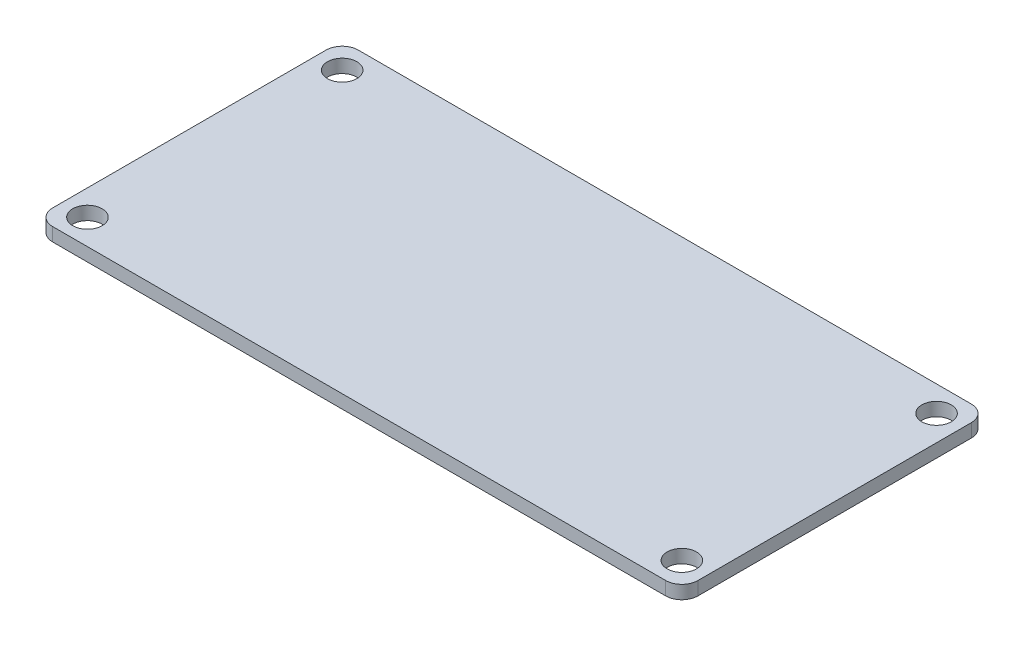
ISO-10303-21;
HEADER;
FILE_DESCRIPTION(('STEP AP214'),'2;1');
FILE_NAME('part.step','',(''),(''),'','','');
FILE_SCHEMA(('AUTOMOTIVE_DESIGN { 1 0 10303 214 1 1 1 1 }'));
ENDSEC;
DATA;
#1=APPLICATION_CONTEXT('core data for automotive mechanical design processes');
#2=APPLICATION_PROTOCOL_DEFINITION('international standard','automotive_design',2000,#1);
#3=PRODUCT_CONTEXT('',#1,'mechanical');
#4=PRODUCT('Part','Part','',(#3));
#5=PRODUCT_RELATED_PRODUCT_CATEGORY('part','',(#4));
#6=PRODUCT_DEFINITION_FORMATION('','',#4);
#7=PRODUCT_DEFINITION_CONTEXT('part definition',#1,'design');
#8=PRODUCT_DEFINITION('design','',#6,#7);
#9=PRODUCT_DEFINITION_SHAPE('','',#8);
#10=(LENGTH_UNIT() NAMED_UNIT(*) SI_UNIT(.MILLI.,.METRE.));
#11=(NAMED_UNIT(*) PLANE_ANGLE_UNIT() SI_UNIT($,.RADIAN.));
#12=(NAMED_UNIT(*) SI_UNIT($,.STERADIAN.) SOLID_ANGLE_UNIT());
#13=UNCERTAINTY_MEASURE_WITH_UNIT(LENGTH_MEASURE(1.E-05),#10,'distance_accuracy_value','');
#14=(GEOMETRIC_REPRESENTATION_CONTEXT(3) GLOBAL_UNCERTAINTY_ASSIGNED_CONTEXT((#13)) GLOBAL_UNIT_ASSIGNED_CONTEXT((#10,
#11,#12)) REPRESENTATION_CONTEXT('',''));
#15=CARTESIAN_POINT('',(0.,0.,0.));
#16=DIRECTION('',(0.,0.,1.));
#17=DIRECTION('',(1.,0.,0.));
#18=AXIS2_PLACEMENT_3D('',#15,#16,#17);
#19=CARTESIAN_POINT('',(0.,1.,0.));
#20=DIRECTION('',(1.,0.,0.));
#21=DIRECTION('',(0.,0.,-1.));
#22=AXIS2_PLACEMENT_3D('',#19,#20,#21);
#23=PLANE('',#22);
#24=DIRECTION('',(0.,0.,1.));
#25=VECTOR('',#24,1.);
#26=CARTESIAN_POINT('',(0.,1.,0.));
#27=LINE('',#26,#25);
#28=CARTESIAN_POINT('',(0.,1.,-21.6535));
#29=VERTEX_POINT('',#28);
#30=CARTESIAN_POINT('',(0.,1.,-1.2065));
#31=VERTEX_POINT('',#30);
#32=EDGE_CURVE('E184',#29,#31,#27,.T.);
#33=ORIENTED_EDGE('',*,*,#32,.F.);
#34=DIRECTION('',(0.,-1.,0.));
#35=VECTOR('',#34,1.);
#36=CARTESIAN_POINT('',(0.,1.,-21.6535));
#37=LINE('',#36,#35);
#38=CARTESIAN_POINT('',(0.,0.,-21.6535));
#39=VERTEX_POINT('',#38);
#40=EDGE_CURVE('E42',#29,#39,#37,.T.);
#41=ORIENTED_EDGE('',*,*,#40,.T.);
#42=DIRECTION('',(0.,0.,1.));
#43=VECTOR('',#42,1.);
#44=CARTESIAN_POINT('',(0.,0.,0.));
#45=LINE('',#44,#43);
#46=CARTESIAN_POINT('',(0.,0.,-15.43));
#47=VERTEX_POINT('',#46);
#48=EDGE_CURVE('E198',#39,#47,#45,.T.);
#49=ORIENTED_EDGE('',*,*,#48,.T.);
#50=CARTESIAN_POINT('',(0.,0.,-7.43));
#51=VERTEX_POINT('',#50);
#52=EDGE_CURVE('E202',#47,#51,#45,.T.);
#53=ORIENTED_EDGE('',*,*,#52,.T.);
#54=CARTESIAN_POINT('',(0.,0.,-1.2065));
#55=VERTEX_POINT('',#54);
#56=EDGE_CURVE('E183',#51,#55,#45,.T.);
#57=ORIENTED_EDGE('',*,*,#56,.T.);
#58=DIRECTION('',(0.,-1.,0.));
#59=VECTOR('',#58,1.);
#60=CARTESIAN_POINT('',(0.,1.,-1.2065));
#61=LINE('',#60,#59);
#62=EDGE_CURVE('E240',#55,#31,#61,.F.);
#63=ORIENTED_EDGE('',*,*,#62,.T.);
#64=EDGE_LOOP('',(#33,#41,#49,#53,#57,#63));
#65=FACE_BOUND('',#64,.T.);
#66=ADVANCED_FACE('F38',(#65),#23,.F.);
#67=CARTESIAN_POINT('',(0.,1.,0.));
#68=DIRECTION('',(0.,0.,-1.));
#69=DIRECTION('',(-1.,0.,0.));
#70=AXIS2_PLACEMENT_3D('',#67,#68,#69);
#71=PLANE('',#70);
#72=DIRECTION('',(1.,0.,0.));
#73=VECTOR('',#72,1.);
#74=CARTESIAN_POINT('',(0.,0.,0.));
#75=LINE('',#74,#73);
#76=CARTESIAN_POINT('',(1.2065,0.,0.));
#77=VERTEX_POINT('',#76);
#78=CARTESIAN_POINT('',(47.0535,0.,0.));
#79=VERTEX_POINT('',#78);
#80=EDGE_CURVE('E201',#77,#79,#75,.T.);
#81=ORIENTED_EDGE('',*,*,#80,.T.);
#82=DIRECTION('',(0.,-1.,0.));
#83=VECTOR('',#82,1.);
#84=CARTESIAN_POINT('',(47.0535,1.,0.));
#85=LINE('',#84,#83);
#86=CARTESIAN_POINT('',(47.0535,1.,0.));
#87=VERTEX_POINT('',#86);
#88=EDGE_CURVE('E239',#79,#87,#85,.F.);
#89=ORIENTED_EDGE('',*,*,#88,.T.);
#90=DIRECTION('',(1.,0.,0.));
#91=VECTOR('',#90,1.);
#92=CARTESIAN_POINT('',(0.,1.,0.));
#93=LINE('',#92,#91);
#94=CARTESIAN_POINT('',(1.2065,1.,0.));
#95=VERTEX_POINT('',#94);
#96=EDGE_CURVE('E187',#95,#87,#93,.T.);
#97=ORIENTED_EDGE('',*,*,#96,.F.);
#98=DIRECTION('',(0.,-1.,0.));
#99=VECTOR('',#98,1.);
#100=CARTESIAN_POINT('',(1.2065,1.,0.));
#101=LINE('',#100,#99);
#102=EDGE_CURVE('E236',#95,#77,#101,.T.);
#103=ORIENTED_EDGE('',*,*,#102,.T.);
#104=EDGE_LOOP('',(#81,#89,#97,#103));
#105=FACE_BOUND('',#104,.T.);
#106=ADVANCED_FACE('F283',(#105),#71,.F.);
#107=CARTESIAN_POINT('',(48.26,1.,0.));
#108=DIRECTION('',(-1.,0.,0.));
#109=DIRECTION('',(0.,0.,1.));
#110=AXIS2_PLACEMENT_3D('',#107,#108,#109);
#111=PLANE('',#110);
#112=DIRECTION('',(0.,0.,-1.));
#113=VECTOR('',#112,1.);
#114=CARTESIAN_POINT('',(48.26,0.,0.));
#115=LINE('',#114,#113);
#116=CARTESIAN_POINT('',(48.26,0.,-1.2065));
#117=VERTEX_POINT('',#116);
#118=CARTESIAN_POINT('',(48.26,0.,-21.6535));
#119=VERTEX_POINT('',#118);
#120=EDGE_CURVE('E205',#117,#119,#115,.T.);
#121=ORIENTED_EDGE('',*,*,#120,.T.);
#122=DIRECTION('',(0.,-1.,0.));
#123=VECTOR('',#122,1.);
#124=CARTESIAN_POINT('',(48.26,1.,-21.6535));
#125=LINE('',#124,#123);
#126=CARTESIAN_POINT('',(48.26,1.,-21.6535));
#127=VERTEX_POINT('',#126);
#128=EDGE_CURVE('E226',#119,#127,#125,.F.);
#129=ORIENTED_EDGE('',*,*,#128,.T.);
#130=DIRECTION('',(0.,0.,-1.));
#131=VECTOR('',#130,1.);
#132=CARTESIAN_POINT('',(48.26,1.,0.));
#133=LINE('',#132,#131);
#134=CARTESIAN_POINT('',(48.26,1.,-1.2065));
#135=VERTEX_POINT('',#134);
#136=EDGE_CURVE('E191',#135,#127,#133,.T.);
#137=ORIENTED_EDGE('',*,*,#136,.F.);
#138=DIRECTION('',(0.,-1.,0.));
#139=VECTOR('',#138,1.);
#140=CARTESIAN_POINT('',(48.26,1.,-1.2065));
#141=LINE('',#140,#139);
#142=EDGE_CURVE('E223',#135,#117,#141,.T.);
#143=ORIENTED_EDGE('',*,*,#142,.T.);
#144=EDGE_LOOP('',(#121,#129,#137,#143));
#145=FACE_BOUND('',#144,.T.);
#146=ADVANCED_FACE('F291',(#145),#111,.F.);
#147=CARTESIAN_POINT('',(0.,1.,-22.86));
#148=DIRECTION('',(0.,0.,1.));
#149=DIRECTION('',(1.,0.,0.));
#150=AXIS2_PLACEMENT_3D('',#147,#148,#149);
#151=PLANE('',#150);
#152=DIRECTION('',(-1.,0.,0.));
#153=VECTOR('',#152,1.);
#154=CARTESIAN_POINT('',(0.,1.,-22.86));
#155=LINE('',#154,#153);
#156=CARTESIAN_POINT('',(47.0535,1.,-22.86));
#157=VERTEX_POINT('',#156);
#158=CARTESIAN_POINT('',(1.2065,1.,-22.86));
#159=VERTEX_POINT('',#158);
#160=EDGE_CURVE('E194',#157,#159,#155,.T.);
#161=ORIENTED_EDGE('',*,*,#160,.F.);
#162=DIRECTION('',(0.,-1.,0.));
#163=VECTOR('',#162,1.);
#164=CARTESIAN_POINT('',(47.0535,1.,-22.86));
#165=LINE('',#164,#163);
#166=CARTESIAN_POINT('',(47.0535,0.,-22.86));
#167=VERTEX_POINT('',#166);
#168=EDGE_CURVE('E211',#157,#167,#165,.T.);
#169=ORIENTED_EDGE('',*,*,#168,.T.);
#170=DIRECTION('',(-1.,0.,0.));
#171=VECTOR('',#170,1.);
#172=CARTESIAN_POINT('',(0.,0.,-22.86));
#173=LINE('',#172,#171);
#174=CARTESIAN_POINT('',(1.2065,0.,-22.86));
#175=VERTEX_POINT('',#174);
#176=EDGE_CURVE('E188',#167,#175,#173,.T.);
#177=ORIENTED_EDGE('',*,*,#176,.T.);
#178=DIRECTION('',(0.,-1.,0.));
#179=VECTOR('',#178,1.);
#180=CARTESIAN_POINT('',(1.2065,1.,-22.86));
#181=LINE('',#180,#179);
#182=EDGE_CURVE('E197',#175,#159,#181,.F.);
#183=ORIENTED_EDGE('',*,*,#182,.T.);
#184=EDGE_LOOP('',(#161,#169,#177,#183));
#185=FACE_BOUND('',#184,.T.);
#186=ADVANCED_FACE('F299',(#185),#151,.F.);
#187=CARTESIAN_POINT('',(0.,1.,0.));
#188=DIRECTION('',(0.,-1.,0.));
#189=DIRECTION('',(0.,0.,-1.));
#190=AXIS2_PLACEMENT_3D('',#187,#188,#189);
#191=PLANE('',#190);
#192=CARTESIAN_POINT('',(46.355,1.,-20.955));
#193=DIRECTION('',(0.,-1.,0.));
#194=DIRECTION('',(0.,0.,-1.));
#195=AXIS2_PLACEMENT_3D('',#192,#193,#194);
#196=CIRCLE('',#195,1.09982);
#197=CARTESIAN_POINT('',(46.355,1.,-22.05482));
#198=VERTEX_POINT('',#197);
#199=EDGE_CURVE('E180',#198,#198,#196,.T.);
#200=ORIENTED_EDGE('',*,*,#199,.T.);
#201=EDGE_LOOP('',(#200));
#202=FACE_BOUND('',#201,.T.);
#203=CARTESIAN_POINT('',(46.355,1.,-1.905));
#204=DIRECTION('',(0.,-1.,0.));
#205=DIRECTION('',(0.,0.,-1.));
#206=AXIS2_PLACEMENT_3D('',#203,#204,#205);
#207=CIRCLE('',#206,1.09982);
#208=CARTESIAN_POINT('',(46.355,1.,-3.00482));
#209=VERTEX_POINT('',#208);
#210=EDGE_CURVE('E177',#209,#209,#207,.T.);
#211=ORIENTED_EDGE('',*,*,#210,.T.);
#212=EDGE_LOOP('',(#211));
#213=FACE_BOUND('',#212,.T.);
#214=CARTESIAN_POINT('',(1.905,1.,-1.905));
#215=DIRECTION('',(0.,-1.,0.));
#216=DIRECTION('',(0.,0.,-1.));
#217=AXIS2_PLACEMENT_3D('',#214,#215,#216);
#218=CIRCLE('',#217,1.09982);
#219=CARTESIAN_POINT('',(1.905,1.,-3.00482));
#220=VERTEX_POINT('',#219);
#221=EDGE_CURVE('E174',#220,#220,#218,.T.);
#222=ORIENTED_EDGE('',*,*,#221,.T.);
#223=EDGE_LOOP('',(#222));
#224=FACE_BOUND('',#223,.T.);
#225=CARTESIAN_POINT('',(1.905,1.,-20.955));
#226=DIRECTION('',(0.,-1.,0.));
#227=DIRECTION('',(0.,0.,-1.));
#228=AXIS2_PLACEMENT_3D('',#225,#226,#227);
#229=CIRCLE('',#228,1.09982);
#230=CARTESIAN_POINT('',(1.905,1.,-22.05482));
#231=VERTEX_POINT('',#230);
#232=EDGE_CURVE('E171',#231,#231,#229,.T.);
#233=ORIENTED_EDGE('',*,*,#232,.T.);
#234=EDGE_LOOP('',(#233));
#235=FACE_BOUND('',#234,.T.);
#236=ORIENTED_EDGE('',*,*,#136,.T.);
#237=CARTESIAN_POINT('',(47.0535,1.,-21.6535));
#238=DIRECTION('',(0.,-1.,0.));
#239=DIRECTION('',(0.,0.,-1.));
#240=AXIS2_PLACEMENT_3D('',#237,#238,#239);
#241=CIRCLE('',#240,1.2065);
#242=EDGE_CURVE('E234',#127,#157,#241,.F.);
#243=ORIENTED_EDGE('',*,*,#242,.T.);
#244=ORIENTED_EDGE('',*,*,#160,.T.);
#245=CARTESIAN_POINT('',(1.2065,1.,-21.6535));
#246=DIRECTION('',(0.,-1.,0.));
#247=DIRECTION('',(0.,0.,-1.));
#248=AXIS2_PLACEMENT_3D('',#245,#246,#247);
#249=CIRCLE('',#248,1.2065);
#250=EDGE_CURVE('E230',#159,#29,#249,.F.);
#251=ORIENTED_EDGE('',*,*,#250,.T.);
#252=ORIENTED_EDGE('',*,*,#32,.T.);
#253=CARTESIAN_POINT('',(1.2065,1.,-1.2065));
#254=DIRECTION('',(0.,-1.,0.));
#255=DIRECTION('',(0.,0.,-1.));
#256=AXIS2_PLACEMENT_3D('',#253,#254,#255);
#257=CIRCLE('',#256,1.2065);
#258=EDGE_CURVE('E228',#31,#95,#257,.F.);
#259=ORIENTED_EDGE('',*,*,#258,.T.);
#260=ORIENTED_EDGE('',*,*,#96,.T.);
#261=CARTESIAN_POINT('',(47.0535,1.,-1.2065));
#262=DIRECTION('',(0.,-1.,0.));
#263=DIRECTION('',(0.,0.,-1.));
#264=AXIS2_PLACEMENT_3D('',#261,#262,#263);
#265=CIRCLE('',#264,1.2065);
#266=EDGE_CURVE('E232',#87,#135,#265,.F.);
#267=ORIENTED_EDGE('',*,*,#266,.T.);
#268=EDGE_LOOP('',(#236,#243,#244,#251,#252,#259,#260,#267));
#269=FACE_BOUND('',#268,.T.);
#270=ADVANCED_FACE('F280',(#202,#213,#224,#235,#269),#191,.F.);
#271=CARTESIAN_POINT('',(0.,0.,0.));
#272=DIRECTION('',(0.,-1.,0.));
#273=DIRECTION('',(0.,0.,-1.));
#274=AXIS2_PLACEMENT_3D('',#271,#272,#273);
#275=PLANE('',#274);
#276=DIRECTION('',(1.,0.,0.));
#277=VECTOR('',#276,1.);
#278=CARTESIAN_POINT('',(5.1,0.,-15.43));
#279=LINE('',#278,#277);
#280=CARTESIAN_POINT('',(5.1,0.,-15.43));
#281=VERTEX_POINT('',#280);
#282=EDGE_CURVE('E11',#47,#281,#279,.T.);
#283=ORIENTED_EDGE('',*,*,#282,.F.);
#284=ORIENTED_EDGE('',*,*,#48,.F.);
#285=CARTESIAN_POINT('',(1.2065,0.,-21.6535));
#286=DIRECTION('',(0.,-1.,0.));
#287=DIRECTION('',(0.,0.,-1.));
#288=AXIS2_PLACEMENT_3D('',#285,#286,#287);
#289=CIRCLE('',#288,1.2065);
#290=EDGE_CURVE('E217',#39,#175,#289,.T.);
#291=ORIENTED_EDGE('',*,*,#290,.T.);
#292=ORIENTED_EDGE('',*,*,#176,.F.);
#293=CARTESIAN_POINT('',(47.0535,0.,-21.6535));
#294=DIRECTION('',(0.,-1.,0.));
#295=DIRECTION('',(0.,0.,-1.));
#296=AXIS2_PLACEMENT_3D('',#293,#294,#295);
#297=CIRCLE('',#296,1.2065);
#298=EDGE_CURVE('E221',#167,#119,#297,.T.);
#299=ORIENTED_EDGE('',*,*,#298,.T.);
#300=ORIENTED_EDGE('',*,*,#120,.F.);
#301=CARTESIAN_POINT('',(47.0535,0.,-1.2065));
#302=DIRECTION('',(0.,-1.,0.));
#303=DIRECTION('',(0.,0.,-1.));
#304=AXIS2_PLACEMENT_3D('',#301,#302,#303);
#305=CIRCLE('',#304,1.2065);
#306=EDGE_CURVE('E219',#117,#79,#305,.T.);
#307=ORIENTED_EDGE('',*,*,#306,.T.);
#308=ORIENTED_EDGE('',*,*,#80,.F.);
#309=CARTESIAN_POINT('',(1.2065,0.,-1.2065));
#310=DIRECTION('',(0.,-1.,0.));
#311=DIRECTION('',(0.,0.,-1.));
#312=AXIS2_PLACEMENT_3D('',#309,#310,#311);
#313=CIRCLE('',#312,1.2065);
#314=EDGE_CURVE('E214',#77,#55,#313,.T.);
#315=ORIENTED_EDGE('',*,*,#314,.T.);
#316=ORIENTED_EDGE('',*,*,#56,.F.);
#317=DIRECTION('',(-1.,0.,0.));
#318=VECTOR('',#317,1.);
#319=CARTESIAN_POINT('',(5.1,0.,-7.43));
#320=LINE('',#319,#318);
#321=CARTESIAN_POINT('',(5.1,0.,-7.43));
#322=VERTEX_POINT('',#321);
#323=EDGE_CURVE('E59',#322,#51,#320,.T.);
#324=ORIENTED_EDGE('',*,*,#323,.F.);
#325=DIRECTION('',(0.,0.,1.));
#326=VECTOR('',#325,1.);
#327=CARTESIAN_POINT('',(5.1,0.,-15.43));
#328=LINE('',#327,#326);
#329=EDGE_CURVE('E55',#281,#322,#328,.T.);
#330=ORIENTED_EDGE('',*,*,#329,.F.);
#331=EDGE_LOOP('',(#283,#284,#291,#292,#299,#300,#307,#308,#315,#316,#324,#330));
#332=FACE_BOUND('',#331,.T.);
#333=CARTESIAN_POINT('',(46.355,0.,-20.955));
#334=DIRECTION('',(0.,1.,0.));
#335=DIRECTION('',(0.,0.,1.));
#336=AXIS2_PLACEMENT_3D('',#333,#334,#335);
#337=CIRCLE('',#336,1.09982);
#338=CARTESIAN_POINT('',(46.355,0.,-19.85518));
#339=VERTEX_POINT('',#338);
#340=EDGE_CURVE('E154',#339,#339,#337,.T.);
#341=ORIENTED_EDGE('',*,*,#340,.T.);
#342=EDGE_LOOP('',(#341));
#343=FACE_BOUND('',#342,.T.);
#344=CARTESIAN_POINT('',(46.355,0.,-1.905));
#345=DIRECTION('',(0.,1.,0.));
#346=DIRECTION('',(0.,0.,1.));
#347=AXIS2_PLACEMENT_3D('',#344,#345,#346);
#348=CIRCLE('',#347,1.09982);
#349=CARTESIAN_POINT('',(46.355,0.,-0.805179999999998));
#350=VERTEX_POINT('',#349);
#351=EDGE_CURVE('E157',#350,#350,#348,.T.);
#352=ORIENTED_EDGE('',*,*,#351,.T.);
#353=EDGE_LOOP('',(#352));
#354=FACE_BOUND('',#353,.T.);
#355=CARTESIAN_POINT('',(1.905,0.,-1.905));
#356=DIRECTION('',(0.,1.,0.));
#357=DIRECTION('',(0.,0.,1.));
#358=AXIS2_PLACEMENT_3D('',#355,#356,#357);
#359=CIRCLE('',#358,1.09982);
#360=CARTESIAN_POINT('',(1.905,0.,-0.805180000000001));
#361=VERTEX_POINT('',#360);
#362=EDGE_CURVE('E163',#361,#361,#359,.T.);
#363=ORIENTED_EDGE('',*,*,#362,.T.);
#364=EDGE_LOOP('',(#363));
#365=FACE_BOUND('',#364,.T.);
#366=CARTESIAN_POINT('',(1.905,0.,-20.955));
#367=DIRECTION('',(0.,1.,0.));
#368=DIRECTION('',(0.,0.,1.));
#369=AXIS2_PLACEMENT_3D('',#366,#367,#368);
#370=CIRCLE('',#369,1.09982);
#371=CARTESIAN_POINT('',(1.905,0.,-19.85518));
#372=VERTEX_POINT('',#371);
#373=EDGE_CURVE('E166',#372,#372,#370,.T.);
#374=ORIENTED_EDGE('',*,*,#373,.T.);
#375=EDGE_LOOP('',(#374));
#376=FACE_BOUND('',#375,.T.);
#377=ADVANCED_FACE('F250',(#332,#343,#354,#365,#376),#275,.T.);
#378=CARTESIAN_POINT('',(1.905,0.,-20.955));
#379=DIRECTION('',(0.,1.,0.));
#380=DIRECTION('',(0.,0.,1.));
#381=AXIS2_PLACEMENT_3D('',#378,#379,#380);
#382=CYLINDRICAL_SURFACE('',#381,1.09982);
#383=ORIENTED_EDGE('',*,*,#373,.F.);
#384=EDGE_LOOP('',(#383));
#385=FACE_BOUND('',#384,.T.);
#386=ORIENTED_EDGE('',*,*,#232,.F.);
#387=EDGE_LOOP('',(#386));
#388=FACE_BOUND('',#387,.T.);
#389=ADVANCED_FACE('F334',(#385,#388),#382,.F.);
#390=CARTESIAN_POINT('',(1.905,0.,-1.905));
#391=DIRECTION('',(0.,1.,0.));
#392=DIRECTION('',(0.,0.,1.));
#393=AXIS2_PLACEMENT_3D('',#390,#391,#392);
#394=CYLINDRICAL_SURFACE('',#393,1.09982);
#395=ORIENTED_EDGE('',*,*,#362,.F.);
#396=EDGE_LOOP('',(#395));
#397=FACE_BOUND('',#396,.T.);
#398=ORIENTED_EDGE('',*,*,#221,.F.);
#399=EDGE_LOOP('',(#398));
#400=FACE_BOUND('',#399,.T.);
#401=ADVANCED_FACE('F327',(#397,#400),#394,.F.);
#402=CARTESIAN_POINT('',(46.355,0.,-1.905));
#403=DIRECTION('',(0.,1.,0.));
#404=DIRECTION('',(0.,0.,1.));
#405=AXIS2_PLACEMENT_3D('',#402,#403,#404);
#406=CYLINDRICAL_SURFACE('',#405,1.09982);
#407=ORIENTED_EDGE('',*,*,#351,.F.);
#408=EDGE_LOOP('',(#407));
#409=FACE_BOUND('',#408,.T.);
#410=ORIENTED_EDGE('',*,*,#210,.F.);
#411=EDGE_LOOP('',(#410));
#412=FACE_BOUND('',#411,.T.);
#413=ADVANCED_FACE('F321',(#409,#412),#406,.F.);
#414=CARTESIAN_POINT('',(46.355,0.,-20.955));
#415=DIRECTION('',(0.,1.,0.));
#416=DIRECTION('',(0.,0.,1.));
#417=AXIS2_PLACEMENT_3D('',#414,#415,#416);
#418=CYLINDRICAL_SURFACE('',#417,1.09982);
#419=ORIENTED_EDGE('',*,*,#340,.F.);
#420=EDGE_LOOP('',(#419));
#421=FACE_BOUND('',#420,.T.);
#422=ORIENTED_EDGE('',*,*,#199,.F.);
#423=EDGE_LOOP('',(#422));
#424=FACE_BOUND('',#423,.T.);
#425=ADVANCED_FACE('F317',(#421,#424),#418,.F.);
#426=CARTESIAN_POINT('',(47.0535,1.,-21.6535));
#427=DIRECTION('',(0.,-1.,0.));
#428=DIRECTION('',(0.,0.,-1.));
#429=AXIS2_PLACEMENT_3D('',#426,#427,#428);
#430=CYLINDRICAL_SURFACE('',#429,1.2065);
#431=ORIENTED_EDGE('',*,*,#242,.F.);
#432=ORIENTED_EDGE('',*,*,#128,.F.);
#433=ORIENTED_EDGE('',*,*,#298,.F.);
#434=ORIENTED_EDGE('',*,*,#168,.F.);
#435=EDGE_LOOP('',(#431,#432,#433,#434));
#436=FACE_BOUND('',#435,.T.);
#437=ADVANCED_FACE('F295',(#436),#430,.T.);
#438=CARTESIAN_POINT('',(47.0535,1.,-1.2065));
#439=DIRECTION('',(0.,-1.,0.));
#440=DIRECTION('',(0.,0.,-1.));
#441=AXIS2_PLACEMENT_3D('',#438,#439,#440);
#442=CYLINDRICAL_SURFACE('',#441,1.2065);
#443=ORIENTED_EDGE('',*,*,#266,.F.);
#444=ORIENTED_EDGE('',*,*,#88,.F.);
#445=ORIENTED_EDGE('',*,*,#306,.F.);
#446=ORIENTED_EDGE('',*,*,#142,.F.);
#447=EDGE_LOOP('',(#443,#444,#445,#446));
#448=FACE_BOUND('',#447,.T.);
#449=ADVANCED_FACE('F286',(#448),#442,.T.);
#450=CARTESIAN_POINT('',(1.2065,1.,-21.6535));
#451=DIRECTION('',(0.,-1.,0.));
#452=DIRECTION('',(0.,0.,-1.));
#453=AXIS2_PLACEMENT_3D('',#450,#451,#452);
#454=CYLINDRICAL_SURFACE('',#453,1.2065);
#455=ORIENTED_EDGE('',*,*,#250,.F.);
#456=ORIENTED_EDGE('',*,*,#182,.F.);
#457=ORIENTED_EDGE('',*,*,#290,.F.);
#458=ORIENTED_EDGE('',*,*,#40,.F.);
#459=EDGE_LOOP('',(#455,#456,#457,#458));
#460=FACE_BOUND('',#459,.T.);
#461=ADVANCED_FACE('F301',(#460),#454,.T.);
#462=CARTESIAN_POINT('',(1.2065,1.,-1.2065));
#463=DIRECTION('',(0.,-1.,0.));
#464=DIRECTION('',(0.,0.,-1.));
#465=AXIS2_PLACEMENT_3D('',#462,#463,#464);
#466=CYLINDRICAL_SURFACE('',#465,1.2065);
#467=ORIENTED_EDGE('',*,*,#258,.F.);
#468=ORIENTED_EDGE('',*,*,#62,.F.);
#469=ORIENTED_EDGE('',*,*,#314,.F.);
#470=ORIENTED_EDGE('',*,*,#102,.F.);
#471=EDGE_LOOP('',(#467,#468,#469,#470));
#472=FACE_BOUND('',#471,.T.);
#473=ADVANCED_FACE('F40',(#472),#466,.T.);
#474=CARTESIAN_POINT('',(5.1,-3.5,-15.43));
#475=DIRECTION('',(-1.,0.,0.));
#476=DIRECTION('',(0.,0.,1.));
#477=AXIS2_PLACEMENT_3D('',#474,#475,#476);
#478=PLANE('',#477);
#479=ORIENTED_EDGE('',*,*,#329,.T.);
#480=DIRECTION('',(0.,1.,0.));
#481=VECTOR('',#480,1.);
#482=CARTESIAN_POINT('',(5.1,-3.5,-7.43));
#483=LINE('',#482,#481);
#484=CARTESIAN_POINT('',(5.1,-3.5,-7.43));
#485=VERTEX_POINT('',#484);
#486=EDGE_CURVE('E137',#485,#322,#483,.T.);
#487=ORIENTED_EDGE('',*,*,#486,.F.);
#488=DIRECTION('',(0.,0.,1.));
#489=VECTOR('',#488,1.);
#490=CARTESIAN_POINT('',(5.1,-3.5,-15.43));
#491=LINE('',#490,#489);
#492=CARTESIAN_POINT('',(5.1,-3.5,-15.43));
#493=VERTEX_POINT('',#492);
#494=EDGE_CURVE('E143',#493,#485,#491,.T.);
#495=ORIENTED_EDGE('',*,*,#494,.F.);
#496=DIRECTION('',(0.,1.,0.));
#497=VECTOR('',#496,1.);
#498=CARTESIAN_POINT('',(5.1,-3.5,-15.43));
#499=LINE('',#498,#497);
#500=EDGE_CURVE('E256',#493,#281,#499,.T.);
#501=ORIENTED_EDGE('',*,*,#500,.T.);
#502=EDGE_LOOP('',(#479,#487,#495,#501));
#503=FACE_BOUND('',#502,.T.);
#504=ADVANCED_FACE('F153',(#503),#478,.F.);
#505=CARTESIAN_POINT('',(5.1,-3.5,-7.43));
#506=DIRECTION('',(0.,0.,-1.));
#507=DIRECTION('',(-1.,0.,0.));
#508=AXIS2_PLACEMENT_3D('',#505,#506,#507);
#509=PLANE('',#508);
#510=ORIENTED_EDGE('',*,*,#323,.T.);
#511=CARTESIAN_POINT('',(-1.,0.,-7.43));
#512=VERTEX_POINT('',#511);
#513=EDGE_CURVE('E265',#51,#512,#320,.T.);
#514=ORIENTED_EDGE('',*,*,#513,.T.);
#515=DIRECTION('',(0.,1.,0.));
#516=VECTOR('',#515,1.);
#517=CARTESIAN_POINT('',(-1.,-3.5,-7.43));
#518=LINE('',#517,#516);
#519=CARTESIAN_POINT('',(-1.,-3.5,-7.43));
#520=VERTEX_POINT('',#519);
#521=EDGE_CURVE('E139',#520,#512,#518,.T.);
#522=ORIENTED_EDGE('',*,*,#521,.F.);
#523=DIRECTION('',(-1.,0.,0.));
#524=VECTOR('',#523,1.);
#525=CARTESIAN_POINT('',(5.1,-3.5,-7.43));
#526=LINE('',#525,#524);
#527=EDGE_CURVE('E133',#485,#520,#526,.T.);
#528=ORIENTED_EDGE('',*,*,#527,.F.);
#529=ORIENTED_EDGE('',*,*,#486,.T.);
#530=EDGE_LOOP('',(#510,#514,#522,#528,#529));
#531=FACE_BOUND('',#530,.T.);
#532=ADVANCED_FACE('F135',(#531),#509,.F.);
#533=CARTESIAN_POINT('',(-1.,-3.5,-15.43));
#534=DIRECTION('',(1.,0.,0.));
#535=DIRECTION('',(0.,0.,-1.));
#536=AXIS2_PLACEMENT_3D('',#533,#534,#535);
#537=PLANE('',#536);
#538=DIRECTION('',(0.,0.,-1.));
#539=VECTOR('',#538,1.);
#540=CARTESIAN_POINT('',(-1.,0.,-15.43));
#541=LINE('',#540,#539);
#542=CARTESIAN_POINT('',(-1.,0.,-15.43));
#543=VERTEX_POINT('',#542);
#544=EDGE_CURVE('E262',#512,#543,#541,.T.);
#545=ORIENTED_EDGE('',*,*,#544,.T.);
#546=DIRECTION('',(0.,1.,0.));
#547=VECTOR('',#546,1.);
#548=CARTESIAN_POINT('',(-1.,-3.5,-15.43));
#549=LINE('',#548,#547);
#550=CARTESIAN_POINT('',(-1.,-3.5,-15.43));
#551=VERTEX_POINT('',#550);
#552=EDGE_CURVE('E159',#551,#543,#549,.T.);
#553=ORIENTED_EDGE('',*,*,#552,.F.);
#554=DIRECTION('',(0.,0.,-1.));
#555=VECTOR('',#554,1.);
#556=CARTESIAN_POINT('',(-1.,-3.5,-15.43));
#557=LINE('',#556,#555);
#558=EDGE_CURVE('E142',#520,#551,#557,.T.);
#559=ORIENTED_EDGE('',*,*,#558,.F.);
#560=ORIENTED_EDGE('',*,*,#521,.T.);
#561=EDGE_LOOP('',(#545,#553,#559,#560));
#562=FACE_BOUND('',#561,.T.);
#563=ADVANCED_FACE('F269',(#562),#537,.F.);
#564=CARTESIAN_POINT('',(5.1,-3.5,-15.43));
#565=DIRECTION('',(0.,0.,1.));
#566=DIRECTION('',(1.,0.,0.));
#567=AXIS2_PLACEMENT_3D('',#564,#565,#566);
#568=PLANE('',#567);
#569=EDGE_CURVE('E48',#543,#47,#279,.T.);
#570=ORIENTED_EDGE('',*,*,#569,.T.);
#571=ORIENTED_EDGE('',*,*,#282,.T.);
#572=ORIENTED_EDGE('',*,*,#500,.F.);
#573=DIRECTION('',(1.,0.,0.));
#574=VECTOR('',#573,1.);
#575=CARTESIAN_POINT('',(5.1,-3.5,-15.43));
#576=LINE('',#575,#574);
#577=EDGE_CURVE('E148',#551,#493,#576,.T.);
#578=ORIENTED_EDGE('',*,*,#577,.F.);
#579=ORIENTED_EDGE('',*,*,#552,.T.);
#580=EDGE_LOOP('',(#570,#571,#572,#578,#579));
#581=FACE_BOUND('',#580,.T.);
#582=ADVANCED_FACE('F255',(#581),#568,.F.);
#583=CARTESIAN_POINT('',(0.,-3.5,0.));
#584=DIRECTION('',(0.,-1.,0.));
#585=DIRECTION('',(0.,0.,-1.));
#586=AXIS2_PLACEMENT_3D('',#583,#584,#585);
#587=PLANE('',#586);
#588=ORIENTED_EDGE('',*,*,#494,.T.);
#589=ORIENTED_EDGE('',*,*,#527,.T.);
#590=ORIENTED_EDGE('',*,*,#558,.T.);
#591=ORIENTED_EDGE('',*,*,#577,.T.);
#592=EDGE_LOOP('',(#588,#589,#590,#591));
#593=FACE_BOUND('',#592,.T.);
#594=ADVANCED_FACE('F146',(#593),#587,.T.);
#595=CARTESIAN_POINT('',(0.,0.,0.));
#596=DIRECTION('',(0.,-1.,0.));
#597=DIRECTION('',(0.,0.,-1.));
#598=AXIS2_PLACEMENT_3D('',#595,#596,#597);
#599=PLANE('',#598);
#600=ORIENTED_EDGE('',*,*,#52,.F.);
#601=ORIENTED_EDGE('',*,*,#569,.F.);
#602=ORIENTED_EDGE('',*,*,#544,.F.);
#603=ORIENTED_EDGE('',*,*,#513,.F.);
#604=EDGE_LOOP('',(#600,#601,#602,#603));
#605=FACE_BOUND('',#604,.T.);
#606=ADVANCED_FACE('F272',(#605),#599,.F.);
#607=CLOSED_SHELL('',(#66,#106,#146,#186,#270,#377,#389,#401,#413,#425,#437,#449,#461,#473,#504,
#532,#563,#582,#594,#606));
#608=MANIFOLD_SOLID_BREP('B2',#607);
#609=ADVANCED_BREP_SHAPE_REPRESENTATION('',(#18,#608),#14);
#610=SHAPE_DEFINITION_REPRESENTATION(#9,#609);
ENDSEC;
END-ISO-10303-21;
